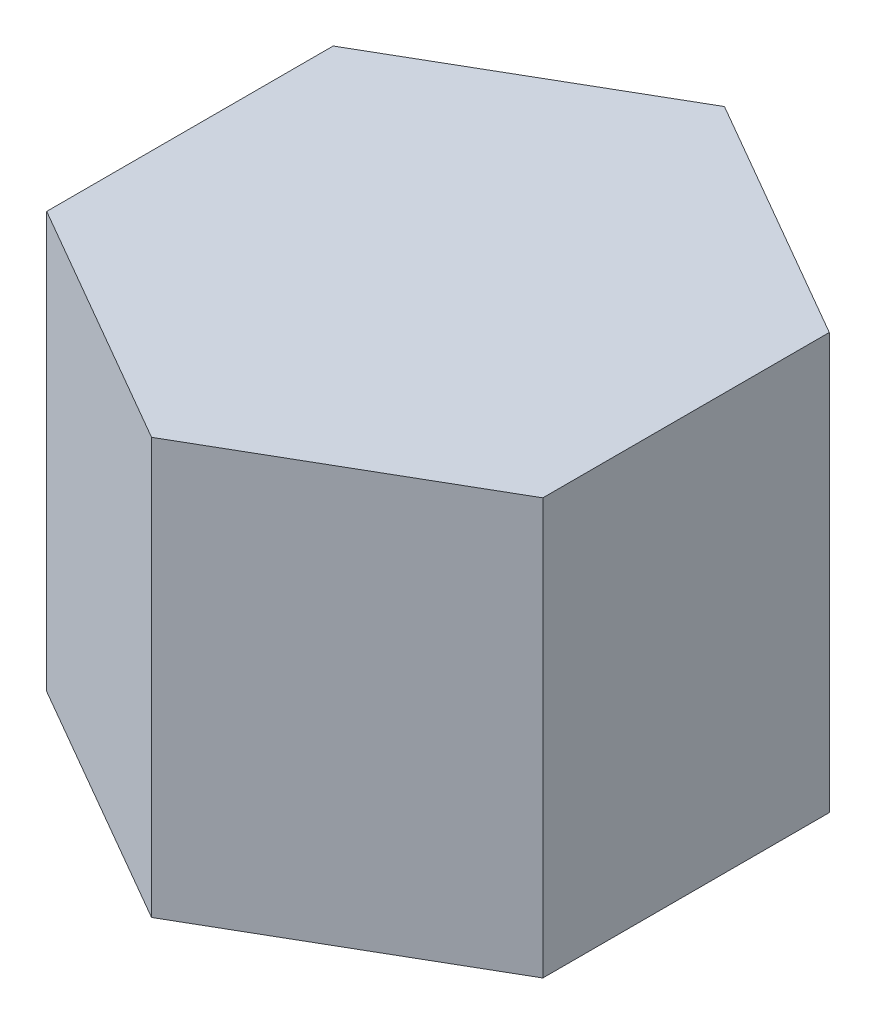
ISO-10303-21;
HEADER;
FILE_DESCRIPTION(('STEP AP214'),'2;1');
FILE_NAME('part.step','',(''),(''),'','','');
FILE_SCHEMA(('AUTOMOTIVE_DESIGN { 1 0 10303 214 1 1 1 1 }'));
ENDSEC;
DATA;
#1=APPLICATION_CONTEXT('core data for automotive mechanical design processes');
#2=APPLICATION_PROTOCOL_DEFINITION('international standard','automotive_design',2000,#1);
#3=PRODUCT_CONTEXT('',#1,'mechanical');
#4=PRODUCT('Part','Part','',(#3));
#5=PRODUCT_RELATED_PRODUCT_CATEGORY('part','',(#4));
#6=PRODUCT_DEFINITION_FORMATION('','',#4);
#7=PRODUCT_DEFINITION_CONTEXT('part definition',#1,'design');
#8=PRODUCT_DEFINITION('design','',#6,#7);
#9=PRODUCT_DEFINITION_SHAPE('','',#8);
#10=(LENGTH_UNIT() NAMED_UNIT(*) SI_UNIT(.MILLI.,.METRE.));
#11=(NAMED_UNIT(*) PLANE_ANGLE_UNIT() SI_UNIT($,.RADIAN.));
#12=(NAMED_UNIT(*) SI_UNIT($,.STERADIAN.) SOLID_ANGLE_UNIT());
#13=UNCERTAINTY_MEASURE_WITH_UNIT(LENGTH_MEASURE(1.E-05),#10,'distance_accuracy_value','');
#14=(GEOMETRIC_REPRESENTATION_CONTEXT(3) GLOBAL_UNCERTAINTY_ASSIGNED_CONTEXT((#13)) GLOBAL_UNIT_ASSIGNED_CONTEXT((#10,
#11,#12)) REPRESENTATION_CONTEXT('',''));
#15=CARTESIAN_POINT('',(0.,0.,0.));
#16=DIRECTION('',(0.,0.,1.));
#17=DIRECTION('',(1.,0.,0.));
#18=AXIS2_PLACEMENT_3D('',#15,#16,#17);
#19=CARTESIAN_POINT('',(210.142660308706,-148.537700895744,295.837098239417));
#20=DIRECTION('',(-0.499999999999909,0.,-0.866025403784491));
#21=DIRECTION('',(-0.866025403784491,0.,0.499999999999909));
#22=AXIS2_PLACEMENT_3D('',#19,#20,#21);
#23=PLANE('',#22);
#24=CARTESIAN_POINT('',(209.839551417381,-149.045793579175,296.012098239417));
#25=DIRECTION('',(0.866025403784491,0.,-0.499999999999909));
#26=VECTOR('',#25,1.);
#27=LINE('',#24,#26);
#28=CARTESIAN_POINT('',(209.839551417382,-149.045793579175,296.012098239417));
#29=VERTEX_POINT('',#28);
#30=CARTESIAN_POINT('',(210.142660308706,-149.045793579175,295.837098239417));
#31=VERTEX_POINT('',#30);
#32=EDGE_CURVE('E170',#29,#31,#27,.T.);
#33=ORIENTED_EDGE('',*,*,#32,.T.);
#34=CARTESIAN_POINT('',(210.142660308706,-148.537700895744,295.837098239417));
#35=DIRECTION('',(0.,-1.,0.));
#36=VECTOR('',#35,1.);
#37=LINE('',#34,#36);
#38=CARTESIAN_POINT('',(210.142660308706,-148.537700895744,295.837098239417));
#39=VERTEX_POINT('',#38);
#40=EDGE_CURVE('E35',#39,#31,#37,.T.);
#41=ORIENTED_EDGE('',*,*,#40,.F.);
#42=CARTESIAN_POINT('',(209.839551417381,-148.537700895744,296.012098239417));
#43=DIRECTION('',(0.866025403784491,0.,-0.499999999999909));
#44=VECTOR('',#43,1.);
#45=LINE('',#42,#44);
#46=CARTESIAN_POINT('',(209.839551417382,-148.537700895744,296.012098239417));
#47=VERTEX_POINT('',#46);
#48=EDGE_CURVE('E159',#47,#39,#45,.T.);
#49=ORIENTED_EDGE('',*,*,#48,.F.);
#50=CARTESIAN_POINT('',(209.839551417381,-148.537700895744,296.012098239417));
#51=DIRECTION('',(0.,-1.,0.));
#52=VECTOR('',#51,1.);
#53=LINE('',#50,#52);
#54=EDGE_CURVE('E10',#47,#29,#53,.T.);
#55=ORIENTED_EDGE('',*,*,#54,.T.);
#56=EDGE_LOOP('',(#33,#41,#49,#55));
#57=FACE_BOUND('',#56,.T.);
#58=ADVANCED_FACE('F16',(#57),#23,.F.);
#59=CARTESIAN_POINT('',(209.839551417382,-148.537700895744,296.012098239417));
#60=DIRECTION('',(0.500000000000062,0.,-0.866025403784403));
#61=DIRECTION('',(-0.866025403784403,0.,-0.500000000000062));
#62=AXIS2_PLACEMENT_3D('',#59,#60,#61);
#63=PLANE('',#62);
#64=CARTESIAN_POINT('',(209.536442526057,-149.045793579175,295.837098239417));
#65=DIRECTION('',(0.866025403784403,0.,0.500000000000062));
#66=VECTOR('',#65,1.);
#67=LINE('',#64,#66);
#68=CARTESIAN_POINT('',(209.536442526057,-149.045793579175,295.837098239417));
#69=VERTEX_POINT('',#68);
#70=EDGE_CURVE('E167',#69,#29,#67,.T.);
#71=ORIENTED_EDGE('',*,*,#70,.T.);
#72=ORIENTED_EDGE('',*,*,#54,.F.);
#73=CARTESIAN_POINT('',(209.536442526057,-148.537700895744,295.837098239417));
#74=DIRECTION('',(0.866025403784403,0.,0.500000000000062));
#75=VECTOR('',#74,1.);
#76=LINE('',#73,#75);
#77=CARTESIAN_POINT('',(209.536442526057,-148.537700895744,295.837098239417));
#78=VERTEX_POINT('',#77);
#79=EDGE_CURVE('E156',#78,#47,#76,.T.);
#80=ORIENTED_EDGE('',*,*,#79,.F.);
#81=CARTESIAN_POINT('',(209.536442526057,-148.537700895744,295.837098239417));
#82=DIRECTION('',(0.,-1.,0.));
#83=VECTOR('',#82,1.);
#84=LINE('',#81,#83);
#85=EDGE_CURVE('E27',#78,#69,#84,.T.);
#86=ORIENTED_EDGE('',*,*,#85,.T.);
#87=EDGE_LOOP('',(#71,#72,#80,#86));
#88=FACE_BOUND('',#87,.T.);
#89=ADVANCED_FACE('F189',(#88),#63,.F.);
#90=CARTESIAN_POINT('',(209.536442526057,-148.537700895744,290.831971220494));
#91=DIRECTION('',(1.,0.,0.));
#92=DIRECTION('',(0.,1.,0.));
#93=AXIS2_PLACEMENT_3D('',#90,#91,#92);
#94=PLANE('',#93);
#95=CARTESIAN_POINT('',(209.536442526057,-149.045793579175,295.487098239417));
#96=DIRECTION('',(0.,0.,1.));
#97=VECTOR('',#96,1.);
#98=LINE('',#95,#97);
#99=CARTESIAN_POINT('',(209.536442526057,-149.045793579175,295.487098239417));
#100=VERTEX_POINT('',#99);
#101=EDGE_CURVE('E163',#100,#69,#98,.T.);
#102=ORIENTED_EDGE('',*,*,#101,.T.);
#103=ORIENTED_EDGE('',*,*,#85,.F.);
#104=CARTESIAN_POINT('',(209.536442526057,-148.537700895744,295.487098239417));
#105=DIRECTION('',(0.,0.,1.));
#106=VECTOR('',#105,1.);
#107=LINE('',#104,#106);
#108=CARTESIAN_POINT('',(209.536442526057,-148.537700895744,295.487098239417));
#109=VERTEX_POINT('',#108);
#110=EDGE_CURVE('E106',#109,#78,#107,.T.);
#111=ORIENTED_EDGE('',*,*,#110,.F.);
#112=CARTESIAN_POINT('',(209.536442526057,-148.537700895744,295.487098239417));
#113=DIRECTION('',(0.,-1.,0.));
#114=VECTOR('',#113,1.);
#115=LINE('',#112,#114);
#116=EDGE_CURVE('E94',#109,#100,#115,.T.);
#117=ORIENTED_EDGE('',*,*,#116,.T.);
#118=EDGE_LOOP('',(#102,#103,#111,#117));
#119=FACE_BOUND('',#118,.T.);
#120=ADVANCED_FACE('F198',(#119),#94,.F.);
#121=CARTESIAN_POINT('',(209.536442526057,-148.537700895744,295.487098239417));
#122=DIRECTION('',(0.499999999999978,0.,0.866025403784452));
#123=DIRECTION('',(0.866025403784452,0.,-0.499999999999978));
#124=AXIS2_PLACEMENT_3D('',#121,#122,#123);
#125=PLANE('',#124);
#126=CARTESIAN_POINT('',(209.839551417382,-149.045793579175,295.312098239417));
#127=DIRECTION('',(-0.866025403784452,0.,0.499999999999978));
#128=VECTOR('',#127,1.);
#129=LINE('',#126,#128);
#130=CARTESIAN_POINT('',(209.839551417382,-149.045793579175,295.312098239417));
#131=VERTEX_POINT('',#130);
#132=EDGE_CURVE('E162',#131,#100,#129,.T.);
#133=ORIENTED_EDGE('',*,*,#132,.T.);
#134=ORIENTED_EDGE('',*,*,#116,.F.);
#135=CARTESIAN_POINT('',(209.839551417382,-148.537700895744,295.312098239417));
#136=DIRECTION('',(-0.866025403784452,0.,0.499999999999978));
#137=VECTOR('',#136,1.);
#138=LINE('',#135,#137);
#139=CARTESIAN_POINT('',(209.839551417382,-148.537700895744,295.312098239417));
#140=VERTEX_POINT('',#139);
#141=EDGE_CURVE('E98',#140,#109,#138,.T.);
#142=ORIENTED_EDGE('',*,*,#141,.F.);
#143=CARTESIAN_POINT('',(209.839551417382,-148.537700895744,295.312098239417));
#144=DIRECTION('',(0.,-1.,0.));
#145=VECTOR('',#144,1.);
#146=LINE('',#143,#145);
#147=EDGE_CURVE('E79',#140,#131,#146,.T.);
#148=ORIENTED_EDGE('',*,*,#147,.T.);
#149=EDGE_LOOP('',(#133,#134,#142,#148));
#150=FACE_BOUND('',#149,.T.);
#151=ADVANCED_FACE('F100',(#150),#125,.F.);
#152=CARTESIAN_POINT('',(209.839551417382,-148.537700895744,295.312098239417));
#153=DIRECTION('',(-0.500000000000062,0.,0.866025403784403));
#154=DIRECTION('',(0.866025403784403,0.,0.500000000000062));
#155=AXIS2_PLACEMENT_3D('',#152,#153,#154);
#156=PLANE('',#155);
#157=CARTESIAN_POINT('',(210.142660308706,-149.045793579175,295.487098239417));
#158=DIRECTION('',(-0.866025403784403,0.,-0.500000000000062));
#159=VECTOR('',#158,1.);
#160=LINE('',#157,#159);
#161=CARTESIAN_POINT('',(210.142660308706,-149.045793579175,295.487098239417));
#162=VERTEX_POINT('',#161);
#163=EDGE_CURVE('E88',#162,#131,#160,.T.);
#164=ORIENTED_EDGE('',*,*,#163,.T.);
#165=ORIENTED_EDGE('',*,*,#147,.F.);
#166=CARTESIAN_POINT('',(210.142660308706,-148.537700895744,295.487098239417));
#167=DIRECTION('',(-0.866025403784403,0.,-0.500000000000062));
#168=VECTOR('',#167,1.);
#169=LINE('',#166,#168);
#170=CARTESIAN_POINT('',(210.142660308706,-148.537700895744,295.487098239417));
#171=VERTEX_POINT('',#170);
#172=EDGE_CURVE('E84',#171,#140,#169,.T.);
#173=ORIENTED_EDGE('',*,*,#172,.F.);
#174=CARTESIAN_POINT('',(210.142660308706,-148.537700895744,295.487098239417));
#175=DIRECTION('',(0.,-1.,0.));
#176=VECTOR('',#175,1.);
#177=LINE('',#174,#176);
#178=EDGE_CURVE('E58',#171,#162,#177,.T.);
#179=ORIENTED_EDGE('',*,*,#178,.T.);
#180=EDGE_LOOP('',(#164,#165,#173,#179));
#181=FACE_BOUND('',#180,.T.);
#182=ADVANCED_FACE('F82',(#181),#156,.F.);
#183=CARTESIAN_POINT('',(210.142660308706,-148.537700895744,290.831971220494));
#184=DIRECTION('',(-1.,0.,0.));
#185=DIRECTION('',(0.,-1.,0.));
#186=AXIS2_PLACEMENT_3D('',#183,#184,#185);
#187=PLANE('',#186);
#188=CARTESIAN_POINT('',(210.142660308706,-149.045793579175,295.837098239417));
#189=DIRECTION('',(0.,0.,-1.));
#190=VECTOR('',#189,1.);
#191=LINE('',#188,#190);
#192=EDGE_CURVE('E160',#31,#162,#191,.T.);
#193=ORIENTED_EDGE('',*,*,#192,.T.);
#194=ORIENTED_EDGE('',*,*,#178,.F.);
#195=CARTESIAN_POINT('',(210.142660308706,-148.537700895744,295.837098239417));
#196=DIRECTION('',(0.,0.,-1.));
#197=VECTOR('',#196,1.);
#198=LINE('',#195,#197);
#199=EDGE_CURVE('E112',#39,#171,#198,.T.);
#200=ORIENTED_EDGE('',*,*,#199,.F.);
#201=ORIENTED_EDGE('',*,*,#40,.T.);
#202=EDGE_LOOP('',(#193,#194,#200,#201));
#203=FACE_BOUND('',#202,.T.);
#204=ADVANCED_FACE('F131',(#203),#187,.F.);
#205=CARTESIAN_POINT('',(206.339551417382,-148.537700895744,290.831971220494));
#206=DIRECTION('',(0.,-1.,0.));
#207=DIRECTION('',(1.,0.,0.));
#208=AXIS2_PLACEMENT_3D('',#205,#206,#207);
#209=PLANE('',#208);
#210=ORIENTED_EDGE('',*,*,#48,.T.);
#211=ORIENTED_EDGE('',*,*,#199,.T.);
#212=ORIENTED_EDGE('',*,*,#172,.T.);
#213=ORIENTED_EDGE('',*,*,#141,.T.);
#214=ORIENTED_EDGE('',*,*,#110,.T.);
#215=ORIENTED_EDGE('',*,*,#79,.T.);
#216=EDGE_LOOP('',(#210,#211,#212,#213,#214,#215));
#217=FACE_BOUND('',#216,.T.);
#218=ADVANCED_FACE('F111',(#217),#209,.F.);
#219=CARTESIAN_POINT('',(206.339551417382,-149.045793579175,290.831971220494));
#220=DIRECTION('',(0.,-1.,0.));
#221=DIRECTION('',(1.,0.,0.));
#222=AXIS2_PLACEMENT_3D('',#219,#220,#221);
#223=PLANE('',#222);
#224=ORIENTED_EDGE('',*,*,#32,.F.);
#225=ORIENTED_EDGE('',*,*,#70,.F.);
#226=ORIENTED_EDGE('',*,*,#101,.F.);
#227=ORIENTED_EDGE('',*,*,#132,.F.);
#228=ORIENTED_EDGE('',*,*,#163,.F.);
#229=ORIENTED_EDGE('',*,*,#192,.F.);
#230=EDGE_LOOP('',(#224,#225,#226,#227,#228,#229));
#231=FACE_BOUND('',#230,.T.);
#232=ADVANCED_FACE('F130',(#231),#223,.T.);
#233=CLOSED_SHELL('',(#58,#89,#120,#151,#182,#204,#218,#232));
#234=MANIFOLD_SOLID_BREP('B1',#233);
#235=ADVANCED_BREP_SHAPE_REPRESENTATION('',(#18,#234),#14);
#236=SHAPE_DEFINITION_REPRESENTATION(#9,#235);
ENDSEC;
END-ISO-10303-21;
